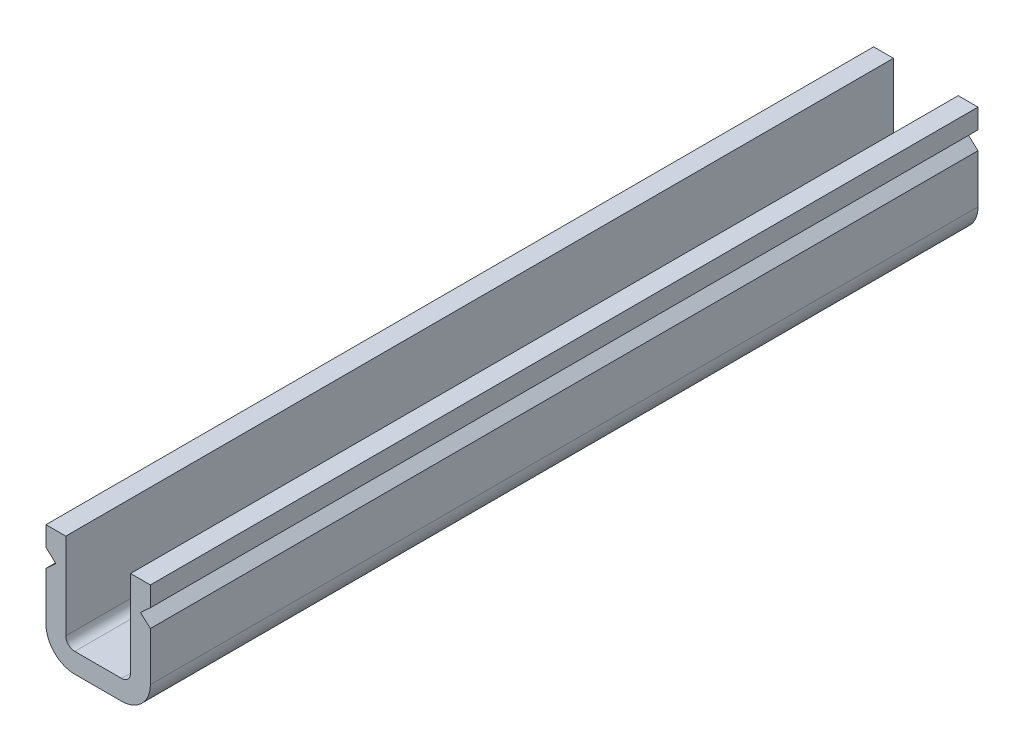
ISO-10303-21;
HEADER;
FILE_DESCRIPTION(('STEP AP214'),'2;1');
FILE_NAME('part.step','',(''),(''),'','','');
FILE_SCHEMA(('AUTOMOTIVE_DESIGN { 1 0 10303 214 1 1 1 1 }'));
ENDSEC;
DATA;
#1=APPLICATION_CONTEXT('core data for automotive mechanical design processes');
#2=APPLICATION_PROTOCOL_DEFINITION('international standard','automotive_design',2000,#1);
#3=PRODUCT_CONTEXT('',#1,'mechanical');
#4=PRODUCT('Part','Part','',(#3));
#5=PRODUCT_RELATED_PRODUCT_CATEGORY('part','',(#4));
#6=PRODUCT_DEFINITION_FORMATION('','',#4);
#7=PRODUCT_DEFINITION_CONTEXT('part definition',#1,'design');
#8=PRODUCT_DEFINITION('design','',#6,#7);
#9=PRODUCT_DEFINITION_SHAPE('','',#8);
#10=(LENGTH_UNIT() NAMED_UNIT(*) SI_UNIT(.MILLI.,.METRE.));
#11=(NAMED_UNIT(*) PLANE_ANGLE_UNIT() SI_UNIT($,.RADIAN.));
#12=(NAMED_UNIT(*) SI_UNIT($,.STERADIAN.) SOLID_ANGLE_UNIT());
#13=UNCERTAINTY_MEASURE_WITH_UNIT(LENGTH_MEASURE(1.E-05),#10,'distance_accuracy_value','');
#14=(GEOMETRIC_REPRESENTATION_CONTEXT(3) GLOBAL_UNCERTAINTY_ASSIGNED_CONTEXT((#13)) GLOBAL_UNIT_ASSIGNED_CONTEXT((#10,
#11,#12)) REPRESENTATION_CONTEXT('',''));
#15=CARTESIAN_POINT('',(0.,0.,0.));
#16=DIRECTION('',(0.,0.,1.));
#17=DIRECTION('',(1.,0.,0.));
#18=AXIS2_PLACEMENT_3D('',#15,#16,#17);
#19=CARTESIAN_POINT('',(1.09999999999999,0.,46.));
#20=DIRECTION('',(0.,-1.,0.));
#21=DIRECTION('',(1.,0.,0.));
#22=AXIS2_PLACEMENT_3D('',#19,#20,#21);
#23=PLANE('',#22);
#24=DIRECTION('',(-1.,0.,0.));
#25=VECTOR('',#24,1.);
#26=CARTESIAN_POINT('',(1.09999999999999,0.,0.));
#27=LINE('',#26,#25);
#28=CARTESIAN_POINT('',(1.09999999999999,0.,0.));
#29=VERTEX_POINT('',#28);
#30=CARTESIAN_POINT('',(0.,0.,0.));
#31=VERTEX_POINT('',#30);
#32=EDGE_CURVE('E186',#29,#31,#27,.T.);
#33=ORIENTED_EDGE('',*,*,#32,.T.);
#34=DIRECTION('',(0.,0.,-1.));
#35=VECTOR('',#34,1.);
#36=CARTESIAN_POINT('',(0.,0.,46.));
#37=LINE('',#36,#35);
#38=CARTESIAN_POINT('',(0.,0.,46.));
#39=VERTEX_POINT('',#38);
#40=EDGE_CURVE('E11',#39,#31,#37,.T.);
#41=ORIENTED_EDGE('',*,*,#40,.F.);
#42=DIRECTION('',(-1.,0.,0.));
#43=VECTOR('',#42,1.);
#44=CARTESIAN_POINT('',(1.09999999999999,0.,46.));
#45=LINE('',#44,#43);
#46=CARTESIAN_POINT('',(1.09999999999999,0.,46.));
#47=VERTEX_POINT('',#46);
#48=EDGE_CURVE('E220',#47,#39,#45,.T.);
#49=ORIENTED_EDGE('',*,*,#48,.F.);
#50=DIRECTION('',(0.,0.,-1.));
#51=VECTOR('',#50,1.);
#52=CARTESIAN_POINT('',(1.09999999999999,0.,46.));
#53=LINE('',#52,#51);
#54=EDGE_CURVE('E182',#47,#29,#53,.T.);
#55=ORIENTED_EDGE('',*,*,#54,.T.);
#56=EDGE_LOOP('',(#33,#41,#49,#55));
#57=FACE_BOUND('',#56,.T.);
#58=ADVANCED_FACE('F30',(#57),#23,.F.);
#59=CARTESIAN_POINT('',(0.,0.,46.));
#60=DIRECTION('',(1.,0.,0.));
#61=DIRECTION('',(0.,0.,-1.));
#62=AXIS2_PLACEMENT_3D('',#59,#60,#61);
#63=PLANE('',#62);
#64=DIRECTION('',(0.,-1.,0.));
#65=VECTOR('',#64,1.);
#66=CARTESIAN_POINT('',(0.,0.,0.));
#67=LINE('',#66,#65);
#68=CARTESIAN_POINT('',(0.,-1.1,0.));
#69=VERTEX_POINT('',#68);
#70=EDGE_CURVE('E189',#31,#69,#67,.T.);
#71=ORIENTED_EDGE('',*,*,#70,.T.);
#72=DIRECTION('',(0.,0.,-1.));
#73=VECTOR('',#72,1.);
#74=CARTESIAN_POINT('',(0.,-1.1,46.));
#75=LINE('',#74,#73);
#76=CARTESIAN_POINT('',(0.,-1.1,46.));
#77=VERTEX_POINT('',#76);
#78=EDGE_CURVE('E38',#77,#69,#75,.T.);
#79=ORIENTED_EDGE('',*,*,#78,.F.);
#80=DIRECTION('',(0.,-1.,0.));
#81=VECTOR('',#80,1.);
#82=CARTESIAN_POINT('',(0.,0.,46.));
#83=LINE('',#82,#81);
#84=EDGE_CURVE('E119',#39,#77,#83,.T.);
#85=ORIENTED_EDGE('',*,*,#84,.F.);
#86=ORIENTED_EDGE('',*,*,#40,.T.);
#87=EDGE_LOOP('',(#71,#79,#85,#86));
#88=FACE_BOUND('',#87,.T.);
#89=ADVANCED_FACE('F328',(#88),#63,.F.);
#90=CARTESIAN_POINT('',(0.,-1.1,46.));
#91=DIRECTION('',(0.672672793996313,0.739940073395944,0.));
#92=DIRECTION('',(-0.739940073395944,0.672672793996313,0.));
#93=AXIS2_PLACEMENT_3D('',#90,#91,#92);
#94=PLANE('',#93);
#95=DIRECTION('',(0.739940073395943,-0.672672793996313,0.));
#96=VECTOR('',#95,1.);
#97=CARTESIAN_POINT('',(0.,-1.1,0.));
#98=LINE('',#97,#96);
#99=CARTESIAN_POINT('',(0.549999999999995,-1.6,0.));
#100=VERTEX_POINT('',#99);
#101=EDGE_CURVE('E191',#69,#100,#98,.T.);
#102=ORIENTED_EDGE('',*,*,#101,.T.);
#103=DIRECTION('',(0.,0.,-1.));
#104=VECTOR('',#103,1.);
#105=CARTESIAN_POINT('',(0.549999999999995,-1.6,46.));
#106=LINE('',#105,#104);
#107=CARTESIAN_POINT('',(0.549999999999995,-1.6,46.));
#108=VERTEX_POINT('',#107);
#109=EDGE_CURVE('E257',#108,#100,#106,.T.);
#110=ORIENTED_EDGE('',*,*,#109,.F.);
#111=DIRECTION('',(0.739940073395943,-0.672672793996313,0.));
#112=VECTOR('',#111,1.);
#113=CARTESIAN_POINT('',(0.,-1.1,46.));
#114=LINE('',#113,#112);
#115=EDGE_CURVE('E265',#77,#108,#114,.T.);
#116=ORIENTED_EDGE('',*,*,#115,.F.);
#117=ORIENTED_EDGE('',*,*,#78,.T.);
#118=EDGE_LOOP('',(#102,#110,#116,#117));
#119=FACE_BOUND('',#118,.T.);
#120=ADVANCED_FACE('F263',(#119),#94,.F.);
#121=CARTESIAN_POINT('',(0.,-2.1,46.));
#122=DIRECTION('',(0.672672793996316,-0.739940073395941,0.));
#123=DIRECTION('',(0.739940073395941,0.672672793996316,0.));
#124=AXIS2_PLACEMENT_3D('',#121,#122,#123);
#125=PLANE('',#124);
#126=DIRECTION('',(-0.739940073395941,-0.672672793996316,0.));
#127=VECTOR('',#126,1.);
#128=CARTESIAN_POINT('',(0.,-2.1,0.));
#129=LINE('',#128,#127);
#130=CARTESIAN_POINT('',(0.,-2.1,0.));
#131=VERTEX_POINT('',#130);
#132=EDGE_CURVE('E193',#100,#131,#129,.T.);
#133=ORIENTED_EDGE('',*,*,#132,.T.);
#134=DIRECTION('',(0.,0.,-1.));
#135=VECTOR('',#134,1.);
#136=CARTESIAN_POINT('',(0.,-2.1,46.));
#137=LINE('',#136,#135);
#138=CARTESIAN_POINT('',(0.,-2.1,46.));
#139=VERTEX_POINT('',#138);
#140=EDGE_CURVE('E254',#139,#131,#137,.T.);
#141=ORIENTED_EDGE('',*,*,#140,.F.);
#142=DIRECTION('',(-0.739940073395941,-0.672672793996316,0.));
#143=VECTOR('',#142,1.);
#144=CARTESIAN_POINT('',(0.,-2.1,46.));
#145=LINE('',#144,#143);
#146=EDGE_CURVE('E283',#108,#139,#145,.T.);
#147=ORIENTED_EDGE('',*,*,#146,.F.);
#148=ORIENTED_EDGE('',*,*,#109,.T.);
#149=EDGE_LOOP('',(#133,#141,#147,#148));
#150=FACE_BOUND('',#149,.T.);
#151=ADVANCED_FACE('F274',(#150),#125,.F.);
#152=CARTESIAN_POINT('',(0.,-2.1,46.));
#153=DIRECTION('',(1.,0.,0.));
#154=DIRECTION('',(0.,1.,0.));
#155=AXIS2_PLACEMENT_3D('',#152,#153,#154);
#156=PLANE('',#155);
#157=DIRECTION('',(0.,-1.,0.));
#158=VECTOR('',#157,1.);
#159=CARTESIAN_POINT('',(0.,-2.1,0.));
#160=LINE('',#159,#158);
#161=CARTESIAN_POINT('',(0.,-4.79999999999998,0.));
#162=VERTEX_POINT('',#161);
#163=EDGE_CURVE('E195',#131,#162,#160,.T.);
#164=ORIENTED_EDGE('',*,*,#163,.T.);
#165=DIRECTION('',(0.,0.,-1.));
#166=VECTOR('',#165,1.);
#167=CARTESIAN_POINT('',(0.,-4.79999999999998,46.));
#168=LINE('',#167,#166);
#169=CARTESIAN_POINT('',(0.,-4.79999999999998,46.));
#170=VERTEX_POINT('',#169);
#171=EDGE_CURVE('E251',#170,#162,#168,.T.);
#172=ORIENTED_EDGE('',*,*,#171,.F.);
#173=DIRECTION('',(0.,-1.,0.));
#174=VECTOR('',#173,1.);
#175=CARTESIAN_POINT('',(0.,-2.1,46.));
#176=LINE('',#175,#174);
#177=EDGE_CURVE('E280',#139,#170,#176,.T.);
#178=ORIENTED_EDGE('',*,*,#177,.F.);
#179=ORIENTED_EDGE('',*,*,#140,.T.);
#180=EDGE_LOOP('',(#164,#172,#178,#179));
#181=FACE_BOUND('',#180,.T.);
#182=ADVANCED_FACE('F278',(#181),#156,.F.);
#183=CARTESIAN_POINT('',(1.6,-4.79999999999998,46.));
#184=DIRECTION('',(0.,0.,-1.));
#185=DIRECTION('',(-1.,0.,0.));
#186=AXIS2_PLACEMENT_3D('',#183,#184,#185);
#187=CYLINDRICAL_SURFACE('',#186,1.6);
#188=CARTESIAN_POINT('',(1.6,-4.79999999999998,0.));
#189=DIRECTION('',(0.,0.,1.));
#190=DIRECTION('',(1.,0.,0.));
#191=AXIS2_PLACEMENT_3D('',#188,#189,#190);
#192=CIRCLE('',#191,1.6);
#193=CARTESIAN_POINT('',(1.6,-6.39999999999998,0.));
#194=VERTEX_POINT('',#193);
#195=EDGE_CURVE('E197',#162,#194,#192,.T.);
#196=ORIENTED_EDGE('',*,*,#195,.T.);
#197=DIRECTION('',(0.,0.,-1.));
#198=VECTOR('',#197,1.);
#199=CARTESIAN_POINT('',(1.6,-6.39999999999998,46.));
#200=LINE('',#199,#198);
#201=CARTESIAN_POINT('',(1.6,-6.39999999999998,46.));
#202=VERTEX_POINT('',#201);
#203=EDGE_CURVE('E248',#202,#194,#200,.T.);
#204=ORIENTED_EDGE('',*,*,#203,.F.);
#205=CARTESIAN_POINT('',(1.6,-4.79999999999998,46.));
#206=DIRECTION('',(0.,0.,1.));
#207=DIRECTION('',(1.,0.,0.));
#208=AXIS2_PLACEMENT_3D('',#205,#206,#207);
#209=CIRCLE('',#208,1.6);
#210=EDGE_CURVE('E282',#170,#202,#209,.T.);
#211=ORIENTED_EDGE('',*,*,#210,.F.);
#212=ORIENTED_EDGE('',*,*,#171,.T.);
#213=EDGE_LOOP('',(#196,#204,#211,#212));
#214=FACE_BOUND('',#213,.T.);
#215=ADVANCED_FACE('F341',(#214),#187,.T.);
#216=CARTESIAN_POINT('',(1.6,-6.39999999999998,46.));
#217=DIRECTION('',(0.,1.,0.));
#218=DIRECTION('',(0.,0.,1.));
#219=AXIS2_PLACEMENT_3D('',#216,#217,#218);
#220=PLANE('',#219);
#221=DIRECTION('',(1.,0.,0.));
#222=VECTOR('',#221,1.);
#223=CARTESIAN_POINT('',(1.6,-6.39999999999998,0.));
#224=LINE('',#223,#222);
#225=CARTESIAN_POINT('',(4.19999999999997,-6.39999999999998,0.));
#226=VERTEX_POINT('',#225);
#227=EDGE_CURVE('E199',#194,#226,#224,.T.);
#228=ORIENTED_EDGE('',*,*,#227,.T.);
#229=DIRECTION('',(0.,0.,-1.));
#230=VECTOR('',#229,1.);
#231=CARTESIAN_POINT('',(4.19999999999997,-6.39999999999998,46.));
#232=LINE('',#231,#230);
#233=CARTESIAN_POINT('',(4.19999999999997,-6.39999999999998,46.));
#234=VERTEX_POINT('',#233);
#235=EDGE_CURVE('E245',#234,#226,#232,.T.);
#236=ORIENTED_EDGE('',*,*,#235,.F.);
#237=DIRECTION('',(1.,0.,0.));
#238=VECTOR('',#237,1.);
#239=CARTESIAN_POINT('',(1.6,-6.39999999999998,46.));
#240=LINE('',#239,#238);
#241=EDGE_CURVE('E285',#202,#234,#240,.T.);
#242=ORIENTED_EDGE('',*,*,#241,.F.);
#243=ORIENTED_EDGE('',*,*,#203,.T.);
#244=EDGE_LOOP('',(#228,#236,#242,#243));
#245=FACE_BOUND('',#244,.T.);
#246=ADVANCED_FACE('F344',(#245),#220,.F.);
#247=CARTESIAN_POINT('',(4.19999999999997,-4.79999999999998,46.));
#248=DIRECTION('',(0.,0.,-1.));
#249=DIRECTION('',(-1.,0.,0.));
#250=AXIS2_PLACEMENT_3D('',#247,#248,#249);
#251=CYLINDRICAL_SURFACE('',#250,1.6);
#252=CARTESIAN_POINT('',(4.19999999999997,-4.79999999999998,0.));
#253=DIRECTION('',(0.,0.,1.));
#254=DIRECTION('',(1.,0.,0.));
#255=AXIS2_PLACEMENT_3D('',#252,#253,#254);
#256=CIRCLE('',#255,1.6);
#257=CARTESIAN_POINT('',(5.79999999999997,-4.79999999999998,0.));
#258=VERTEX_POINT('',#257);
#259=EDGE_CURVE('E201',#226,#258,#256,.T.);
#260=ORIENTED_EDGE('',*,*,#259,.T.);
#261=DIRECTION('',(0.,0.,-1.));
#262=VECTOR('',#261,1.);
#263=CARTESIAN_POINT('',(5.79999999999997,-4.79999999999998,46.));
#264=LINE('',#263,#262);
#265=CARTESIAN_POINT('',(5.79999999999997,-4.79999999999998,46.));
#266=VERTEX_POINT('',#265);
#267=EDGE_CURVE('E242',#266,#258,#264,.T.);
#268=ORIENTED_EDGE('',*,*,#267,.F.);
#269=CARTESIAN_POINT('',(4.19999999999997,-4.79999999999998,46.));
#270=DIRECTION('',(0.,0.,1.));
#271=DIRECTION('',(1.,0.,0.));
#272=AXIS2_PLACEMENT_3D('',#269,#270,#271);
#273=CIRCLE('',#272,1.6);
#274=EDGE_CURVE('E291',#234,#266,#273,.T.);
#275=ORIENTED_EDGE('',*,*,#274,.F.);
#276=ORIENTED_EDGE('',*,*,#235,.T.);
#277=EDGE_LOOP('',(#260,#268,#275,#276));
#278=FACE_BOUND('',#277,.T.);
#279=ADVANCED_FACE('F348',(#278),#251,.T.);
#280=CARTESIAN_POINT('',(5.79999999999998,-4.79999999999998,46.));
#281=DIRECTION('',(-1.,0.,0.));
#282=DIRECTION('',(0.,-1.,0.));
#283=AXIS2_PLACEMENT_3D('',#280,#281,#282);
#284=PLANE('',#283);
#285=DIRECTION('',(0.,1.,0.));
#286=VECTOR('',#285,1.);
#287=CARTESIAN_POINT('',(5.79999999999998,-4.79999999999998,0.));
#288=LINE('',#287,#286);
#289=CARTESIAN_POINT('',(5.79999999999997,-2.1,0.));
#290=VERTEX_POINT('',#289);
#291=EDGE_CURVE('E203',#258,#290,#288,.T.);
#292=ORIENTED_EDGE('',*,*,#291,.T.);
#293=DIRECTION('',(0.,0.,-1.));
#294=VECTOR('',#293,1.);
#295=CARTESIAN_POINT('',(5.79999999999997,-2.1,46.));
#296=LINE('',#295,#294);
#297=CARTESIAN_POINT('',(5.79999999999997,-2.1,46.));
#298=VERTEX_POINT('',#297);
#299=EDGE_CURVE('E239',#298,#290,#296,.T.);
#300=ORIENTED_EDGE('',*,*,#299,.F.);
#301=DIRECTION('',(0.,1.,0.));
#302=VECTOR('',#301,1.);
#303=CARTESIAN_POINT('',(5.79999999999998,-4.79999999999998,46.));
#304=LINE('',#303,#302);
#305=EDGE_CURVE('E293',#266,#298,#304,.T.);
#306=ORIENTED_EDGE('',*,*,#305,.F.);
#307=ORIENTED_EDGE('',*,*,#267,.T.);
#308=EDGE_LOOP('',(#292,#300,#306,#307));
#309=FACE_BOUND('',#308,.T.);
#310=ADVANCED_FACE('F352',(#309),#284,.F.);
#311=CARTESIAN_POINT('',(5.79999999999997,-2.1,46.));
#312=DIRECTION('',(-0.672672793996319,-0.739940073395937,0.));
#313=DIRECTION('',(0.739940073395937,-0.672672793996319,0.));
#314=AXIS2_PLACEMENT_3D('',#311,#312,#313);
#315=PLANE('',#314);
#316=DIRECTION('',(-0.739940073395937,0.672672793996319,0.));
#317=VECTOR('',#316,1.);
#318=CARTESIAN_POINT('',(5.79999999999997,-2.1,0.));
#319=LINE('',#318,#317);
#320=CARTESIAN_POINT('',(5.24999999999999,-1.6,0.));
#321=VERTEX_POINT('',#320);
#322=EDGE_CURVE('E205',#290,#321,#319,.T.);
#323=ORIENTED_EDGE('',*,*,#322,.T.);
#324=DIRECTION('',(0.,0.,-1.));
#325=VECTOR('',#324,1.);
#326=CARTESIAN_POINT('',(5.24999999999999,-1.6,46.));
#327=LINE('',#326,#325);
#328=CARTESIAN_POINT('',(5.24999999999999,-1.6,46.));
#329=VERTEX_POINT('',#328);
#330=EDGE_CURVE('E236',#329,#321,#327,.T.);
#331=ORIENTED_EDGE('',*,*,#330,.F.);
#332=DIRECTION('',(-0.739940073395937,0.672672793996319,0.));
#333=VECTOR('',#332,1.);
#334=CARTESIAN_POINT('',(5.79999999999997,-2.1,46.));
#335=LINE('',#334,#333);
#336=EDGE_CURVE('E295',#298,#329,#335,.T.);
#337=ORIENTED_EDGE('',*,*,#336,.F.);
#338=ORIENTED_EDGE('',*,*,#299,.T.);
#339=EDGE_LOOP('',(#323,#331,#337,#338));
#340=FACE_BOUND('',#339,.T.);
#341=ADVANCED_FACE('F356',(#340),#315,.F.);
#342=CARTESIAN_POINT('',(5.79999999999997,-1.1,46.));
#343=DIRECTION('',(-0.672672793996316,0.73994007339594,0.));
#344=DIRECTION('',(-0.73994007339594,-0.672672793996317,0.));
#345=AXIS2_PLACEMENT_3D('',#342,#343,#344);
#346=PLANE('',#345);
#347=DIRECTION('',(0.73994007339594,0.672672793996317,0.));
#348=VECTOR('',#347,1.);
#349=CARTESIAN_POINT('',(5.79999999999997,-1.1,0.));
#350=LINE('',#349,#348);
#351=CARTESIAN_POINT('',(5.79999999999997,-1.1,0.));
#352=VERTEX_POINT('',#351);
#353=EDGE_CURVE('E207',#321,#352,#350,.T.);
#354=ORIENTED_EDGE('',*,*,#353,.T.);
#355=DIRECTION('',(0.,0.,-1.));
#356=VECTOR('',#355,1.);
#357=CARTESIAN_POINT('',(5.79999999999997,-1.1,46.));
#358=LINE('',#357,#356);
#359=CARTESIAN_POINT('',(5.79999999999997,-1.1,46.));
#360=VERTEX_POINT('',#359);
#361=EDGE_CURVE('E233',#360,#352,#358,.T.);
#362=ORIENTED_EDGE('',*,*,#361,.F.);
#363=DIRECTION('',(0.73994007339594,0.672672793996317,0.));
#364=VECTOR('',#363,1.);
#365=CARTESIAN_POINT('',(5.79999999999997,-1.1,46.));
#366=LINE('',#365,#364);
#367=EDGE_CURVE('E297',#329,#360,#366,.T.);
#368=ORIENTED_EDGE('',*,*,#367,.F.);
#369=ORIENTED_EDGE('',*,*,#330,.T.);
#370=EDGE_LOOP('',(#354,#362,#368,#369));
#371=FACE_BOUND('',#370,.T.);
#372=ADVANCED_FACE('F360',(#371),#346,.F.);
#373=CARTESIAN_POINT('',(5.79999999999997,-1.1,46.));
#374=DIRECTION('',(-1.,0.,0.));
#375=DIRECTION('',(0.,0.,1.));
#376=AXIS2_PLACEMENT_3D('',#373,#374,#375);
#377=PLANE('',#376);
#378=DIRECTION('',(0.,1.,0.));
#379=VECTOR('',#378,1.);
#380=CARTESIAN_POINT('',(5.79999999999997,-1.1,0.));
#381=LINE('',#380,#379);
#382=CARTESIAN_POINT('',(5.79999999999997,0.,0.));
#383=VERTEX_POINT('',#382);
#384=EDGE_CURVE('E209',#352,#383,#381,.T.);
#385=ORIENTED_EDGE('',*,*,#384,.T.);
#386=DIRECTION('',(0.,0.,-1.));
#387=VECTOR('',#386,1.);
#388=CARTESIAN_POINT('',(5.79999999999997,0.,46.));
#389=LINE('',#388,#387);
#390=CARTESIAN_POINT('',(5.79999999999997,0.,46.));
#391=VERTEX_POINT('',#390);
#392=EDGE_CURVE('E230',#391,#383,#389,.T.);
#393=ORIENTED_EDGE('',*,*,#392,.F.);
#394=DIRECTION('',(0.,1.,0.));
#395=VECTOR('',#394,1.);
#396=CARTESIAN_POINT('',(5.79999999999997,-1.1,46.));
#397=LINE('',#396,#395);
#398=EDGE_CURVE('E299',#360,#391,#397,.T.);
#399=ORIENTED_EDGE('',*,*,#398,.F.);
#400=ORIENTED_EDGE('',*,*,#361,.T.);
#401=EDGE_LOOP('',(#385,#393,#399,#400));
#402=FACE_BOUND('',#401,.T.);
#403=ADVANCED_FACE('F364',(#402),#377,.F.);
#404=CARTESIAN_POINT('',(5.79999999999997,0.,46.));
#405=DIRECTION('',(0.,-1.,0.));
#406=DIRECTION('',(1.,0.,0.));
#407=AXIS2_PLACEMENT_3D('',#404,#405,#406);
#408=PLANE('',#407);
#409=DIRECTION('',(-1.,0.,0.));
#410=VECTOR('',#409,1.);
#411=CARTESIAN_POINT('',(5.79999999999997,0.,0.));
#412=LINE('',#411,#410);
#413=CARTESIAN_POINT('',(4.69999999999999,0.,0.));
#414=VERTEX_POINT('',#413);
#415=EDGE_CURVE('E211',#383,#414,#412,.T.);
#416=ORIENTED_EDGE('',*,*,#415,.T.);
#417=DIRECTION('',(0.,0.,-1.));
#418=VECTOR('',#417,1.);
#419=CARTESIAN_POINT('',(4.69999999999999,0.,46.));
#420=LINE('',#419,#418);
#421=CARTESIAN_POINT('',(4.69999999999999,0.,46.));
#422=VERTEX_POINT('',#421);
#423=EDGE_CURVE('E227',#422,#414,#420,.T.);
#424=ORIENTED_EDGE('',*,*,#423,.F.);
#425=DIRECTION('',(-1.,0.,0.));
#426=VECTOR('',#425,1.);
#427=CARTESIAN_POINT('',(5.79999999999997,0.,46.));
#428=LINE('',#427,#426);
#429=EDGE_CURVE('E301',#391,#422,#428,.T.);
#430=ORIENTED_EDGE('',*,*,#429,.F.);
#431=ORIENTED_EDGE('',*,*,#392,.T.);
#432=EDGE_LOOP('',(#416,#424,#430,#431));
#433=FACE_BOUND('',#432,.T.);
#434=ADVANCED_FACE('F368',(#433),#408,.F.);
#435=CARTESIAN_POINT('',(4.69999999999999,-4.8,46.));
#436=DIRECTION('',(1.,0.,0.));
#437=DIRECTION('',(0.,0.,-1.));
#438=AXIS2_PLACEMENT_3D('',#435,#436,#437);
#439=PLANE('',#438);
#440=DIRECTION('',(0.,-1.,0.));
#441=VECTOR('',#440,1.);
#442=CARTESIAN_POINT('',(4.69999999999999,-4.8,0.));
#443=LINE('',#442,#441);
#444=CARTESIAN_POINT('',(4.69999999999999,-4.8,0.));
#445=VERTEX_POINT('',#444);
#446=EDGE_CURVE('E213',#414,#445,#443,.T.);
#447=ORIENTED_EDGE('',*,*,#446,.T.);
#448=DIRECTION('',(0.,0.,-1.));
#449=VECTOR('',#448,1.);
#450=CARTESIAN_POINT('',(4.69999999999999,-4.8,46.));
#451=LINE('',#450,#449);
#452=CARTESIAN_POINT('',(4.69999999999999,-4.8,46.));
#453=VERTEX_POINT('',#452);
#454=EDGE_CURVE('E224',#453,#445,#451,.T.);
#455=ORIENTED_EDGE('',*,*,#454,.F.);
#456=DIRECTION('',(0.,-1.,0.));
#457=VECTOR('',#456,1.);
#458=CARTESIAN_POINT('',(4.69999999999999,-4.8,46.));
#459=LINE('',#458,#457);
#460=EDGE_CURVE('E303',#422,#453,#459,.T.);
#461=ORIENTED_EDGE('',*,*,#460,.F.);
#462=ORIENTED_EDGE('',*,*,#423,.T.);
#463=EDGE_LOOP('',(#447,#455,#461,#462));
#464=FACE_BOUND('',#463,.T.);
#465=ADVANCED_FACE('F309',(#464),#439,.F.);
#466=CARTESIAN_POINT('',(4.19999999999999,-4.8,46.));
#467=DIRECTION('',(0.,0.,-1.));
#468=DIRECTION('',(-1.,0.,0.));
#469=AXIS2_PLACEMENT_3D('',#466,#467,#468);
#470=CYLINDRICAL_SURFACE('',#469,0.5);
#471=CARTESIAN_POINT('',(4.19999999999999,-4.8,0.));
#472=DIRECTION('',(0.,0.,-1.));
#473=DIRECTION('',(-1.,0.,0.));
#474=AXIS2_PLACEMENT_3D('',#471,#472,#473);
#475=CIRCLE('',#474,0.5);
#476=CARTESIAN_POINT('',(4.19999999999999,-5.3,0.));
#477=VERTEX_POINT('',#476);
#478=EDGE_CURVE('E215',#445,#477,#475,.T.);
#479=ORIENTED_EDGE('',*,*,#478,.T.);
#480=DIRECTION('',(0.,0.,-1.));
#481=VECTOR('',#480,1.);
#482=CARTESIAN_POINT('',(4.19999999999999,-5.3,46.));
#483=LINE('',#482,#481);
#484=CARTESIAN_POINT('',(4.19999999999999,-5.3,46.));
#485=VERTEX_POINT('',#484);
#486=EDGE_CURVE('E177',#485,#477,#483,.T.);
#487=ORIENTED_EDGE('',*,*,#486,.F.);
#488=CARTESIAN_POINT('',(4.19999999999999,-4.8,46.));
#489=DIRECTION('',(0.,0.,-1.));
#490=DIRECTION('',(-1.,0.,0.));
#491=AXIS2_PLACEMENT_3D('',#488,#489,#490);
#492=CIRCLE('',#491,0.5);
#493=EDGE_CURVE('E168',#453,#485,#492,.T.);
#494=ORIENTED_EDGE('',*,*,#493,.F.);
#495=ORIENTED_EDGE('',*,*,#454,.T.);
#496=EDGE_LOOP('',(#479,#487,#494,#495));
#497=FACE_BOUND('',#496,.T.);
#498=ADVANCED_FACE('F313',(#497),#470,.F.);
#499=CARTESIAN_POINT('',(1.59999999999999,-5.3,46.));
#500=DIRECTION('',(0.,-1.,0.));
#501=DIRECTION('',(0.,0.,-1.));
#502=AXIS2_PLACEMENT_3D('',#499,#500,#501);
#503=PLANE('',#502);
#504=DIRECTION('',(-1.,0.,0.));
#505=VECTOR('',#504,1.);
#506=CARTESIAN_POINT('',(1.59999999999999,-5.3,0.));
#507=LINE('',#506,#505);
#508=CARTESIAN_POINT('',(1.59999999999999,-5.3,0.));
#509=VERTEX_POINT('',#508);
#510=EDGE_CURVE('E176',#477,#509,#507,.T.);
#511=ORIENTED_EDGE('',*,*,#510,.T.);
#512=DIRECTION('',(0.,0.,-1.));
#513=VECTOR('',#512,1.);
#514=CARTESIAN_POINT('',(1.59999999999999,-5.3,46.));
#515=LINE('',#514,#513);
#516=CARTESIAN_POINT('',(1.59999999999999,-5.3,46.));
#517=VERTEX_POINT('',#516);
#518=EDGE_CURVE('E173',#517,#509,#515,.T.);
#519=ORIENTED_EDGE('',*,*,#518,.F.);
#520=DIRECTION('',(-1.,0.,0.));
#521=VECTOR('',#520,1.);
#522=CARTESIAN_POINT('',(1.59999999999999,-5.3,46.));
#523=LINE('',#522,#521);
#524=EDGE_CURVE('E162',#485,#517,#523,.T.);
#525=ORIENTED_EDGE('',*,*,#524,.F.);
#526=ORIENTED_EDGE('',*,*,#486,.T.);
#527=EDGE_LOOP('',(#511,#519,#525,#526));
#528=FACE_BOUND('',#527,.T.);
#529=ADVANCED_FACE('F174',(#528),#503,.F.);
#530=CARTESIAN_POINT('',(1.59999999999999,-4.8,46.));
#531=DIRECTION('',(0.,0.,-1.));
#532=DIRECTION('',(-1.,0.,0.));
#533=AXIS2_PLACEMENT_3D('',#530,#531,#532);
#534=CYLINDRICAL_SURFACE('',#533,0.5);
#535=CARTESIAN_POINT('',(1.59999999999999,-4.8,0.));
#536=DIRECTION('',(0.,0.,-1.));
#537=DIRECTION('',(1.,0.,0.));
#538=AXIS2_PLACEMENT_3D('',#535,#536,#537);
#539=CIRCLE('',#538,0.5);
#540=CARTESIAN_POINT('',(1.09999999999999,-4.8,0.));
#541=VERTEX_POINT('',#540);
#542=EDGE_CURVE('E105',#509,#541,#539,.T.);
#543=ORIENTED_EDGE('',*,*,#542,.T.);
#544=DIRECTION('',(0.,0.,-1.));
#545=VECTOR('',#544,1.);
#546=CARTESIAN_POINT('',(1.09999999999999,-4.8,46.));
#547=LINE('',#546,#545);
#548=CARTESIAN_POINT('',(1.09999999999999,-4.8,46.));
#549=VERTEX_POINT('',#548);
#550=EDGE_CURVE('E178',#549,#541,#547,.T.);
#551=ORIENTED_EDGE('',*,*,#550,.F.);
#552=CARTESIAN_POINT('',(1.59999999999999,-4.8,46.));
#553=DIRECTION('',(0.,0.,-1.));
#554=DIRECTION('',(1.,0.,0.));
#555=AXIS2_PLACEMENT_3D('',#552,#553,#554);
#556=CIRCLE('',#555,0.5);
#557=EDGE_CURVE('E166',#517,#549,#556,.T.);
#558=ORIENTED_EDGE('',*,*,#557,.F.);
#559=ORIENTED_EDGE('',*,*,#518,.T.);
#560=EDGE_LOOP('',(#543,#551,#558,#559));
#561=FACE_BOUND('',#560,.T.);
#562=ADVANCED_FACE('F180',(#561),#534,.F.);
#563=CARTESIAN_POINT('',(1.09999999999999,0.,46.));
#564=DIRECTION('',(-1.,0.,0.));
#565=DIRECTION('',(0.,-1.,0.));
#566=AXIS2_PLACEMENT_3D('',#563,#564,#565);
#567=PLANE('',#566);
#568=DIRECTION('',(0.,1.,0.));
#569=VECTOR('',#568,1.);
#570=CARTESIAN_POINT('',(1.09999999999999,0.,0.));
#571=LINE('',#570,#569);
#572=EDGE_CURVE('E111',#541,#29,#571,.T.);
#573=ORIENTED_EDGE('',*,*,#572,.T.);
#574=ORIENTED_EDGE('',*,*,#54,.F.);
#575=DIRECTION('',(0.,1.,0.));
#576=VECTOR('',#575,1.);
#577=CARTESIAN_POINT('',(1.09999999999999,0.,46.));
#578=LINE('',#577,#576);
#579=EDGE_CURVE('E46',#549,#47,#578,.T.);
#580=ORIENTED_EDGE('',*,*,#579,.F.);
#581=ORIENTED_EDGE('',*,*,#550,.T.);
#582=EDGE_LOOP('',(#573,#574,#580,#581));
#583=FACE_BOUND('',#582,.T.);
#584=ADVANCED_FACE('F317',(#583),#567,.F.);
#585=CARTESIAN_POINT('',(1.6,-4.79999999999998,46.));
#586=DIRECTION('',(0.,0.,1.));
#587=DIRECTION('',(1.,0.,0.));
#588=AXIS2_PLACEMENT_3D('',#585,#586,#587);
#589=PLANE('',#588);
#590=ORIENTED_EDGE('',*,*,#48,.T.);
#591=ORIENTED_EDGE('',*,*,#84,.T.);
#592=ORIENTED_EDGE('',*,*,#115,.T.);
#593=ORIENTED_EDGE('',*,*,#146,.T.);
#594=ORIENTED_EDGE('',*,*,#177,.T.);
#595=ORIENTED_EDGE('',*,*,#210,.T.);
#596=ORIENTED_EDGE('',*,*,#241,.T.);
#597=ORIENTED_EDGE('',*,*,#274,.T.);
#598=ORIENTED_EDGE('',*,*,#305,.T.);
#599=ORIENTED_EDGE('',*,*,#336,.T.);
#600=ORIENTED_EDGE('',*,*,#367,.T.);
#601=ORIENTED_EDGE('',*,*,#398,.T.);
#602=ORIENTED_EDGE('',*,*,#429,.T.);
#603=ORIENTED_EDGE('',*,*,#460,.T.);
#604=ORIENTED_EDGE('',*,*,#493,.T.);
#605=ORIENTED_EDGE('',*,*,#524,.T.);
#606=ORIENTED_EDGE('',*,*,#557,.T.);
#607=ORIENTED_EDGE('',*,*,#579,.T.);
#608=EDGE_LOOP('',(#590,#591,#592,#593,#594,#595,#596,#597,#598,#599,#600,#601,#602,#603,#604,
#605,#606,#607));
#609=FACE_BOUND('',#608,.T.);
#610=ADVANCED_FACE('F164',(#609),#589,.T.);
#611=CARTESIAN_POINT('',(1.6,-4.79999999999998,0.));
#612=DIRECTION('',(0.,0.,1.));
#613=DIRECTION('',(1.,0.,0.));
#614=AXIS2_PLACEMENT_3D('',#611,#612,#613);
#615=PLANE('',#614);
#616=ORIENTED_EDGE('',*,*,#32,.F.);
#617=ORIENTED_EDGE('',*,*,#572,.F.);
#618=ORIENTED_EDGE('',*,*,#542,.F.);
#619=ORIENTED_EDGE('',*,*,#510,.F.);
#620=ORIENTED_EDGE('',*,*,#478,.F.);
#621=ORIENTED_EDGE('',*,*,#446,.F.);
#622=ORIENTED_EDGE('',*,*,#415,.F.);
#623=ORIENTED_EDGE('',*,*,#384,.F.);
#624=ORIENTED_EDGE('',*,*,#353,.F.);
#625=ORIENTED_EDGE('',*,*,#322,.F.);
#626=ORIENTED_EDGE('',*,*,#291,.F.);
#627=ORIENTED_EDGE('',*,*,#259,.F.);
#628=ORIENTED_EDGE('',*,*,#227,.F.);
#629=ORIENTED_EDGE('',*,*,#195,.F.);
#630=ORIENTED_EDGE('',*,*,#163,.F.);
#631=ORIENTED_EDGE('',*,*,#132,.F.);
#632=ORIENTED_EDGE('',*,*,#101,.F.);
#633=ORIENTED_EDGE('',*,*,#70,.F.);
#634=EDGE_LOOP('',(#616,#617,#618,#619,#620,#621,#622,#623,#624,#625,#626,#627,#628,#629,#630,
#631,#632,#633));
#635=FACE_BOUND('',#634,.T.);
#636=ADVANCED_FACE('F269',(#635),#615,.F.);
#637=CLOSED_SHELL('',(#58,#89,#120,#151,#182,#215,#246,#279,#310,#341,#372,#403,#434,#465,#498,
#529,#562,#584,#610,#636));
#638=MANIFOLD_SOLID_BREP('B2',#637);
#639=ADVANCED_BREP_SHAPE_REPRESENTATION('',(#18,#638),#14);
#640=SHAPE_DEFINITION_REPRESENTATION(#9,#639);
ENDSEC;
END-ISO-10303-21;
